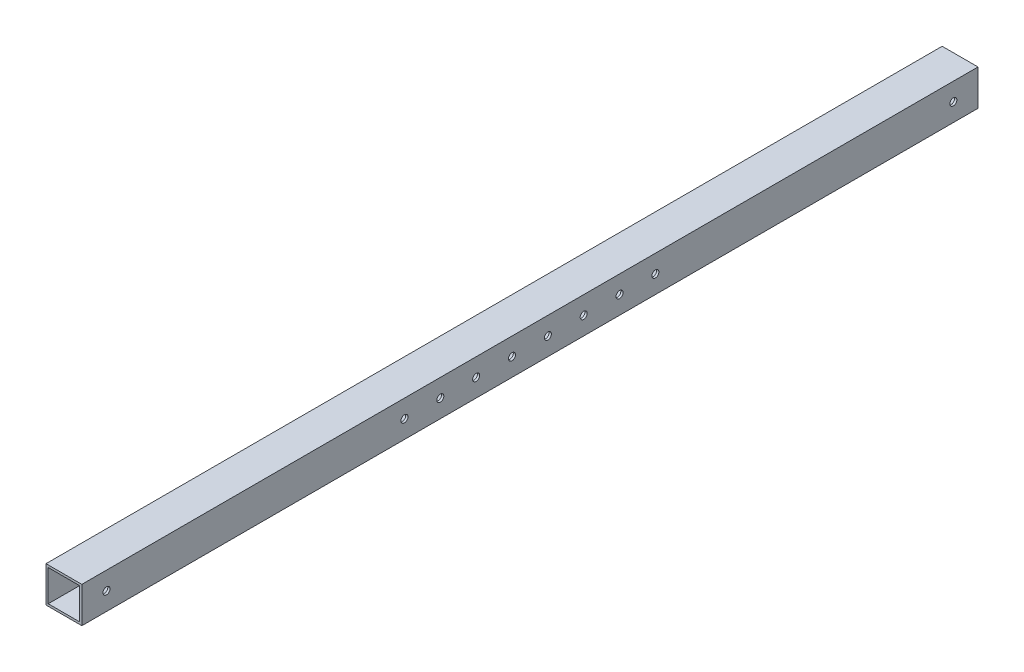
ISO-10303-21;
HEADER;
FILE_DESCRIPTION(('STEP AP214'),'2;1');
FILE_NAME('part.step','',(''),(''),'','','');
FILE_SCHEMA(('AUTOMOTIVE_DESIGN { 1 0 10303 214 1 1 1 1 }'));
ENDSEC;
DATA;
#1=APPLICATION_CONTEXT('core data for automotive mechanical design processes');
#2=APPLICATION_PROTOCOL_DEFINITION('international standard','automotive_design',2000,#1);
#3=PRODUCT_CONTEXT('',#1,'mechanical');
#4=PRODUCT('Part','Part','',(#3));
#5=PRODUCT_RELATED_PRODUCT_CATEGORY('part','',(#4));
#6=PRODUCT_DEFINITION_FORMATION('','',#4);
#7=PRODUCT_DEFINITION_CONTEXT('part definition',#1,'design');
#8=PRODUCT_DEFINITION('design','',#6,#7);
#9=PRODUCT_DEFINITION_SHAPE('','',#8);
#10=(LENGTH_UNIT() NAMED_UNIT(*) SI_UNIT(.MILLI.,.METRE.));
#11=(NAMED_UNIT(*) PLANE_ANGLE_UNIT() SI_UNIT($,.RADIAN.));
#12=(NAMED_UNIT(*) SI_UNIT($,.STERADIAN.) SOLID_ANGLE_UNIT());
#13=UNCERTAINTY_MEASURE_WITH_UNIT(LENGTH_MEASURE(1.E-05),#10,'distance_accuracy_value','');
#14=(GEOMETRIC_REPRESENTATION_CONTEXT(3) GLOBAL_UNCERTAINTY_ASSIGNED_CONTEXT((#13)) GLOBAL_UNIT_ASSIGNED_CONTEXT((#10,
#11,#12)) REPRESENTATION_CONTEXT('',''));
#15=CARTESIAN_POINT('',(0.,0.,0.));
#16=DIRECTION('',(0.,0.,1.));
#17=DIRECTION('',(1.,0.,0.));
#18=AXIS2_PLACEMENT_3D('',#15,#16,#17);
#19=CARTESIAN_POINT('',(-116.088706292712,-80.0228164852255,317.5));
#20=DIRECTION('',(0.,1.,0.));
#21=DIRECTION('',(-1.,0.,0.));
#22=AXIS2_PLACEMENT_3D('',#19,#20,#21);
#23=PLANE('',#22);
#24=DIRECTION('',(1.,0.,0.));
#25=VECTOR('',#24,1.);
#26=CARTESIAN_POINT('',(-116.088706292712,-80.0228164852255,-317.5));
#27=LINE('',#26,#25);
#28=CARTESIAN_POINT('',(-116.088706292712,-80.0228164852255,-317.5));
#29=VERTEX_POINT('',#28);
#30=CARTESIAN_POINT('',(-90.6887062927116,-80.0228164852256,-317.5));
#31=VERTEX_POINT('',#30);
#32=EDGE_CURVE('E11',#29,#31,#27,.T.);
#33=ORIENTED_EDGE('',*,*,#32,.T.);
#34=DIRECTION('',(0.,0.,-1.));
#35=VECTOR('',#34,1.);
#36=CARTESIAN_POINT('',(-90.6887062927116,-80.0228164852256,317.5));
#37=LINE('',#36,#35);
#38=CARTESIAN_POINT('',(-90.6887062927116,-80.0228164852256,317.5));
#39=VERTEX_POINT('',#38);
#40=EDGE_CURVE('E120',#39,#31,#37,.T.);
#41=ORIENTED_EDGE('',*,*,#40,.F.);
#42=DIRECTION('',(1.,0.,0.));
#43=VECTOR('',#42,1.);
#44=CARTESIAN_POINT('',(-116.088706292712,-80.0228164852255,317.5));
#45=LINE('',#44,#43);
#46=CARTESIAN_POINT('',(-116.088706292712,-80.0228164852255,317.5));
#47=VERTEX_POINT('',#46);
#48=EDGE_CURVE('E151',#47,#39,#45,.T.);
#49=ORIENTED_EDGE('',*,*,#48,.F.);
#50=DIRECTION('',(0.,0.,-1.));
#51=VECTOR('',#50,1.);
#52=CARTESIAN_POINT('',(-116.088706292712,-80.0228164852255,317.5));
#53=LINE('',#52,#51);
#54=EDGE_CURVE('E144',#47,#29,#53,.T.);
#55=ORIENTED_EDGE('',*,*,#54,.T.);
#56=EDGE_LOOP('',(#33,#41,#49,#55));
#57=FACE_BOUND('',#56,.T.);
#58=ADVANCED_FACE('F36',(#57),#23,.F.);
#59=CARTESIAN_POINT('',(-90.6887062927116,-80.0228164852256,317.5));
#60=DIRECTION('',(-1.,0.,0.));
#61=DIRECTION('',(0.,-1.,0.));
#62=AXIS2_PLACEMENT_3D('',#59,#60,#61);
#63=PLANE('',#62);
#64=CARTESIAN_POINT('',(-90.6887062927116,-67.3228164852254,88.9));
#65=DIRECTION('',(-1.,0.,0.));
#66=DIRECTION('',(0.,-1.,0.));
#67=AXIS2_PLACEMENT_3D('',#64,#65,#66);
#68=CIRCLE('',#67,2.4892);
#69=CARTESIAN_POINT('',(-90.6887062927116,-69.8120164852254,88.9));
#70=VERTEX_POINT('',#69);
#71=EDGE_CURVE('E224',#70,#70,#68,.T.);
#72=ORIENTED_EDGE('',*,*,#71,.T.);
#73=EDGE_LOOP('',(#72));
#74=FACE_BOUND('',#73,.T.);
#75=CARTESIAN_POINT('',(-90.6887062927116,-67.3228164852255,63.5));
#76=DIRECTION('',(-1.,0.,0.));
#77=DIRECTION('',(0.,-1.,0.));
#78=AXIS2_PLACEMENT_3D('',#75,#76,#77);
#79=CIRCLE('',#78,2.4892);
#80=CARTESIAN_POINT('',(-90.6887062927116,-69.8120164852255,63.5));
#81=VERTEX_POINT('',#80);
#82=EDGE_CURVE('E209',#81,#81,#79,.T.);
#83=ORIENTED_EDGE('',*,*,#82,.T.);
#84=EDGE_LOOP('',(#83));
#85=FACE_BOUND('',#84,.T.);
#86=CARTESIAN_POINT('',(-90.6887062927116,-67.3228164852255,38.1));
#87=DIRECTION('',(-1.,0.,0.));
#88=DIRECTION('',(0.,-1.,0.));
#89=AXIS2_PLACEMENT_3D('',#86,#87,#88);
#90=CIRCLE('',#89,2.4892);
#91=CARTESIAN_POINT('',(-90.6887062927116,-69.8120164852255,38.1));
#92=VERTEX_POINT('',#91);
#93=EDGE_CURVE('E205',#92,#92,#90,.T.);
#94=ORIENTED_EDGE('',*,*,#93,.T.);
#95=EDGE_LOOP('',(#94));
#96=FACE_BOUND('',#95,.T.);
#97=CARTESIAN_POINT('',(-90.6887062927116,-67.3228164852255,12.7));
#98=DIRECTION('',(-1.,0.,0.));
#99=DIRECTION('',(0.,-1.,0.));
#100=AXIS2_PLACEMENT_3D('',#97,#98,#99);
#101=CIRCLE('',#100,2.4892);
#102=CARTESIAN_POINT('',(-90.6887062927116,-69.8120164852255,12.7));
#103=VERTEX_POINT('',#102);
#104=EDGE_CURVE('E201',#103,#103,#101,.T.);
#105=ORIENTED_EDGE('',*,*,#104,.T.);
#106=EDGE_LOOP('',(#105));
#107=FACE_BOUND('',#106,.T.);
#108=CARTESIAN_POINT('',(-90.6887062927116,-67.3228164852255,-12.7));
#109=DIRECTION('',(-1.,0.,0.));
#110=DIRECTION('',(0.,-1.,0.));
#111=AXIS2_PLACEMENT_3D('',#108,#109,#110);
#112=CIRCLE('',#111,2.4892);
#113=CARTESIAN_POINT('',(-90.6887062927116,-69.8120164852255,-12.7));
#114=VERTEX_POINT('',#113);
#115=EDGE_CURVE('E197',#114,#114,#112,.T.);
#116=ORIENTED_EDGE('',*,*,#115,.T.);
#117=EDGE_LOOP('',(#116));
#118=FACE_BOUND('',#117,.T.);
#119=CARTESIAN_POINT('',(-90.6887062927116,-67.3228164852255,-38.1));
#120=DIRECTION('',(-1.,0.,0.));
#121=DIRECTION('',(0.,-1.,0.));
#122=AXIS2_PLACEMENT_3D('',#119,#120,#121);
#123=CIRCLE('',#122,2.4892);
#124=CARTESIAN_POINT('',(-90.6887062927116,-69.8120164852255,-38.1));
#125=VERTEX_POINT('',#124);
#126=EDGE_CURVE('E192',#125,#125,#123,.T.);
#127=ORIENTED_EDGE('',*,*,#126,.T.);
#128=EDGE_LOOP('',(#127));
#129=FACE_BOUND('',#128,.T.);
#130=CARTESIAN_POINT('',(-90.6887062927116,-67.3228164852255,-63.5));
#131=DIRECTION('',(-1.,0.,0.));
#132=DIRECTION('',(0.,-1.,0.));
#133=AXIS2_PLACEMENT_3D('',#130,#131,#132);
#134=CIRCLE('',#133,2.4892);
#135=CARTESIAN_POINT('',(-90.6887062927116,-69.8120164852255,-63.5));
#136=VERTEX_POINT('',#135);
#137=EDGE_CURVE('E187',#136,#136,#134,.T.);
#138=ORIENTED_EDGE('',*,*,#137,.T.);
#139=EDGE_LOOP('',(#138));
#140=FACE_BOUND('',#139,.T.);
#141=CARTESIAN_POINT('',(-90.6887062927116,-67.3228164852255,-88.9));
#142=DIRECTION('',(-1.,0.,0.));
#143=DIRECTION('',(0.,-1.,0.));
#144=AXIS2_PLACEMENT_3D('',#141,#142,#143);
#145=CIRCLE('',#144,2.4892);
#146=CARTESIAN_POINT('',(-90.6887062927116,-69.8120164852255,-88.9));
#147=VERTEX_POINT('',#146);
#148=EDGE_CURVE('E182',#147,#147,#145,.T.);
#149=ORIENTED_EDGE('',*,*,#148,.T.);
#150=EDGE_LOOP('',(#149));
#151=FACE_BOUND('',#150,.T.);
#152=CARTESIAN_POINT('',(-90.6887062927116,-67.3228164852254,300.0375));
#153=DIRECTION('',(-1.,0.,0.));
#154=DIRECTION('',(0.,-1.,0.));
#155=AXIS2_PLACEMENT_3D('',#152,#153,#154);
#156=CIRCLE('',#155,2.48920000000001);
#157=CARTESIAN_POINT('',(-90.6887062927116,-69.8120164852254,300.0375));
#158=VERTEX_POINT('',#157);
#159=EDGE_CURVE('E177',#158,#158,#156,.T.);
#160=ORIENTED_EDGE('',*,*,#159,.T.);
#161=EDGE_LOOP('',(#160));
#162=FACE_BOUND('',#161,.T.);
#163=CARTESIAN_POINT('',(-90.6887062927116,-67.3228164852255,-300.0375));
#164=DIRECTION('',(-1.,0.,0.));
#165=DIRECTION('',(0.,-1.,0.));
#166=AXIS2_PLACEMENT_3D('',#163,#164,#165);
#167=CIRCLE('',#166,2.48920000000002);
#168=CARTESIAN_POINT('',(-90.6887062927116,-69.8120164852255,-300.0375));
#169=VERTEX_POINT('',#168);
#170=EDGE_CURVE('E172',#169,#169,#167,.T.);
#171=ORIENTED_EDGE('',*,*,#170,.T.);
#172=EDGE_LOOP('',(#171));
#173=FACE_BOUND('',#172,.T.);
#174=DIRECTION('',(0.,1.,0.));
#175=VECTOR('',#174,1.);
#176=CARTESIAN_POINT('',(-90.6887062927116,-80.0228164852256,-317.5));
#177=LINE('',#176,#175);
#178=CARTESIAN_POINT('',(-90.6887062927116,-54.6228164852255,-317.5));
#179=VERTEX_POINT('',#178);
#180=EDGE_CURVE('E45',#31,#179,#177,.T.);
#181=ORIENTED_EDGE('',*,*,#180,.T.);
#182=DIRECTION('',(0.,0.,-1.));
#183=VECTOR('',#182,1.);
#184=CARTESIAN_POINT('',(-90.6887062927116,-54.6228164852255,317.5));
#185=LINE('',#184,#183);
#186=CARTESIAN_POINT('',(-90.6887062927116,-54.6228164852255,317.5));
#187=VERTEX_POINT('',#186);
#188=EDGE_CURVE('E139',#187,#179,#185,.T.);
#189=ORIENTED_EDGE('',*,*,#188,.F.);
#190=DIRECTION('',(0.,1.,0.));
#191=VECTOR('',#190,1.);
#192=CARTESIAN_POINT('',(-90.6887062927116,-80.0228164852256,317.5));
#193=LINE('',#192,#191);
#194=EDGE_CURVE('E159',#39,#187,#193,.T.);
#195=ORIENTED_EDGE('',*,*,#194,.F.);
#196=ORIENTED_EDGE('',*,*,#40,.T.);
#197=EDGE_LOOP('',(#181,#189,#195,#196));
#198=FACE_BOUND('',#197,.T.);
#199=ADVANCED_FACE('F248',(#74,#85,#96,#107,#118,#129,#140,#151,#162,#173,#198),#63,.F.);
#200=CARTESIAN_POINT('',(-90.6887062927116,-54.6228164852255,317.5));
#201=DIRECTION('',(0.,-1.,0.));
#202=DIRECTION('',(1.,0.,0.));
#203=AXIS2_PLACEMENT_3D('',#200,#201,#202);
#204=PLANE('',#203);
#205=DIRECTION('',(-1.,0.,0.));
#206=VECTOR('',#205,1.);
#207=CARTESIAN_POINT('',(-90.6887062927116,-54.6228164852255,-317.5));
#208=LINE('',#207,#206);
#209=CARTESIAN_POINT('',(-116.088706292712,-54.6228164852255,-317.5));
#210=VERTEX_POINT('',#209);
#211=EDGE_CURVE('E150',#179,#210,#208,.T.);
#212=ORIENTED_EDGE('',*,*,#211,.T.);
#213=DIRECTION('',(0.,0.,-1.));
#214=VECTOR('',#213,1.);
#215=CARTESIAN_POINT('',(-116.088706292712,-54.6228164852255,317.5));
#216=LINE('',#215,#214);
#217=CARTESIAN_POINT('',(-116.088706292712,-54.6228164852255,317.5));
#218=VERTEX_POINT('',#217);
#219=EDGE_CURVE('E142',#218,#210,#216,.T.);
#220=ORIENTED_EDGE('',*,*,#219,.F.);
#221=DIRECTION('',(-1.,0.,0.));
#222=VECTOR('',#221,1.);
#223=CARTESIAN_POINT('',(-90.6887062927116,-54.6228164852255,317.5));
#224=LINE('',#223,#222);
#225=EDGE_CURVE('E157',#187,#218,#224,.T.);
#226=ORIENTED_EDGE('',*,*,#225,.F.);
#227=ORIENTED_EDGE('',*,*,#188,.T.);
#228=EDGE_LOOP('',(#212,#220,#226,#227));
#229=FACE_BOUND('',#228,.T.);
#230=ADVANCED_FACE('F254',(#229),#204,.F.);
#231=CARTESIAN_POINT('',(-116.088706292712,-80.0228164852255,317.5));
#232=DIRECTION('',(-1.,0.,0.));
#233=DIRECTION('',(0.,0.,1.));
#234=AXIS2_PLACEMENT_3D('',#231,#232,#233);
#235=PLANE('',#234);
#236=CARTESIAN_POINT('',(-116.088706292712,-67.3228164852254,88.9));
#237=DIRECTION('',(-1.,0.,0.));
#238=DIRECTION('',(0.,0.,1.));
#239=AXIS2_PLACEMENT_3D('',#236,#237,#238);
#240=CIRCLE('',#239,2.4892);
#241=CARTESIAN_POINT('',(-116.088706292712,-67.3228164852254,91.3892));
#242=VERTEX_POINT('',#241);
#243=EDGE_CURVE('E167',#242,#242,#240,.T.);
#244=ORIENTED_EDGE('',*,*,#243,.F.);
#245=EDGE_LOOP('',(#244));
#246=FACE_BOUND('',#245,.T.);
#247=CARTESIAN_POINT('',(-116.088706292712,-67.3228164852255,63.5));
#248=DIRECTION('',(-1.,0.,0.));
#249=DIRECTION('',(0.,0.,1.));
#250=AXIS2_PLACEMENT_3D('',#247,#248,#249);
#251=CIRCLE('',#250,2.4892);
#252=CARTESIAN_POINT('',(-116.088706292712,-67.3228164852255,65.9892));
#253=VERTEX_POINT('',#252);
#254=EDGE_CURVE('E609',#253,#253,#251,.T.);
#255=ORIENTED_EDGE('',*,*,#254,.F.);
#256=EDGE_LOOP('',(#255));
#257=FACE_BOUND('',#256,.T.);
#258=CARTESIAN_POINT('',(-116.088706292712,-67.3228164852255,38.1));
#259=DIRECTION('',(-1.,0.,0.));
#260=DIRECTION('',(0.,0.,1.));
#261=AXIS2_PLACEMENT_3D('',#258,#259,#260);
#262=CIRCLE('',#261,2.4892);
#263=CARTESIAN_POINT('',(-116.088706292712,-67.3228164852255,40.5892));
#264=VERTEX_POINT('',#263);
#265=EDGE_CURVE('E606',#264,#264,#262,.T.);
#266=ORIENTED_EDGE('',*,*,#265,.F.);
#267=EDGE_LOOP('',(#266));
#268=FACE_BOUND('',#267,.T.);
#269=CARTESIAN_POINT('',(-116.088706292712,-67.3228164852255,12.7));
#270=DIRECTION('',(-1.,0.,0.));
#271=DIRECTION('',(0.,0.,1.));
#272=AXIS2_PLACEMENT_3D('',#269,#270,#271);
#273=CIRCLE('',#272,2.4892);
#274=CARTESIAN_POINT('',(-116.088706292712,-67.3228164852255,15.1892));
#275=VERTEX_POINT('',#274);
#276=EDGE_CURVE('E603',#275,#275,#273,.T.);
#277=ORIENTED_EDGE('',*,*,#276,.F.);
#278=EDGE_LOOP('',(#277));
#279=FACE_BOUND('',#278,.T.);
#280=CARTESIAN_POINT('',(-116.088706292712,-67.3228164852255,-12.7));
#281=DIRECTION('',(-1.,0.,0.));
#282=DIRECTION('',(0.,0.,1.));
#283=AXIS2_PLACEMENT_3D('',#280,#281,#282);
#284=CIRCLE('',#283,2.4892);
#285=CARTESIAN_POINT('',(-116.088706292712,-67.3228164852255,-10.2108));
#286=VERTEX_POINT('',#285);
#287=EDGE_CURVE('E600',#286,#286,#284,.T.);
#288=ORIENTED_EDGE('',*,*,#287,.F.);
#289=EDGE_LOOP('',(#288));
#290=FACE_BOUND('',#289,.T.);
#291=CARTESIAN_POINT('',(-116.088706292712,-67.3228164852255,-38.1));
#292=DIRECTION('',(-1.,0.,0.));
#293=DIRECTION('',(0.,0.,1.));
#294=AXIS2_PLACEMENT_3D('',#291,#292,#293);
#295=CIRCLE('',#294,2.4892);
#296=CARTESIAN_POINT('',(-116.088706292712,-67.3228164852255,-35.6108));
#297=VERTEX_POINT('',#296);
#298=EDGE_CURVE('E597',#297,#297,#295,.T.);
#299=ORIENTED_EDGE('',*,*,#298,.F.);
#300=EDGE_LOOP('',(#299));
#301=FACE_BOUND('',#300,.T.);
#302=CARTESIAN_POINT('',(-116.088706292712,-67.3228164852255,-63.5));
#303=DIRECTION('',(-1.,0.,0.));
#304=DIRECTION('',(0.,0.,1.));
#305=AXIS2_PLACEMENT_3D('',#302,#303,#304);
#306=CIRCLE('',#305,2.4892);
#307=CARTESIAN_POINT('',(-116.088706292712,-67.3228164852255,-61.0108));
#308=VERTEX_POINT('',#307);
#309=EDGE_CURVE('E594',#308,#308,#306,.T.);
#310=ORIENTED_EDGE('',*,*,#309,.F.);
#311=EDGE_LOOP('',(#310));
#312=FACE_BOUND('',#311,.T.);
#313=CARTESIAN_POINT('',(-116.088706292712,-67.3228164852255,-88.9));
#314=DIRECTION('',(-1.,0.,0.));
#315=DIRECTION('',(0.,0.,1.));
#316=AXIS2_PLACEMENT_3D('',#313,#314,#315);
#317=CIRCLE('',#316,2.4892);
#318=CARTESIAN_POINT('',(-116.088706292712,-67.3228164852255,-86.4108));
#319=VERTEX_POINT('',#318);
#320=EDGE_CURVE('E591',#319,#319,#317,.T.);
#321=ORIENTED_EDGE('',*,*,#320,.F.);
#322=EDGE_LOOP('',(#321));
#323=FACE_BOUND('',#322,.T.);
#324=CARTESIAN_POINT('',(-116.088706292712,-67.3228164852254,300.0375));
#325=DIRECTION('',(-1.,0.,0.));
#326=DIRECTION('',(0.,0.,1.));
#327=AXIS2_PLACEMENT_3D('',#324,#325,#326);
#328=CIRCLE('',#327,2.48920000000001);
#329=CARTESIAN_POINT('',(-116.088706292712,-67.3228164852254,302.5267));
#330=VERTEX_POINT('',#329);
#331=EDGE_CURVE('E588',#330,#330,#328,.T.);
#332=ORIENTED_EDGE('',*,*,#331,.F.);
#333=EDGE_LOOP('',(#332));
#334=FACE_BOUND('',#333,.T.);
#335=CARTESIAN_POINT('',(-116.088706292712,-67.3228164852255,-300.0375));
#336=DIRECTION('',(-1.,0.,0.));
#337=DIRECTION('',(0.,0.,1.));
#338=AXIS2_PLACEMENT_3D('',#335,#336,#337);
#339=CIRCLE('',#338,2.48920000000002);
#340=CARTESIAN_POINT('',(-116.088706292712,-67.3228164852255,-297.5483));
#341=VERTEX_POINT('',#340);
#342=EDGE_CURVE('E585',#341,#341,#339,.T.);
#343=ORIENTED_EDGE('',*,*,#342,.F.);
#344=EDGE_LOOP('',(#343));
#345=FACE_BOUND('',#344,.T.);
#346=DIRECTION('',(0.,1.,0.));
#347=VECTOR('',#346,1.);
#348=CARTESIAN_POINT('',(-116.088706292712,-80.0228164852255,-317.5));
#349=LINE('',#348,#347);
#350=EDGE_CURVE('E147',#29,#210,#349,.T.);
#351=ORIENTED_EDGE('',*,*,#350,.F.);
#352=ORIENTED_EDGE('',*,*,#54,.F.);
#353=DIRECTION('',(0.,1.,0.));
#354=VECTOR('',#353,1.);
#355=CARTESIAN_POINT('',(-116.088706292712,-80.0228164852255,317.5));
#356=LINE('',#355,#354);
#357=EDGE_CURVE('E146',#47,#218,#356,.T.);
#358=ORIENTED_EDGE('',*,*,#357,.T.);
#359=ORIENTED_EDGE('',*,*,#219,.T.);
#360=EDGE_LOOP('',(#351,#352,#358,#359));
#361=FACE_BOUND('',#360,.T.);
#362=ADVANCED_FACE('F261',(#246,#257,#268,#279,#290,#301,#312,#323,#334,#345,#361),#235,.T.);
#363=CARTESIAN_POINT('',(0.,0.,317.5));
#364=DIRECTION('',(0.,0.,1.));
#365=DIRECTION('',(1.,0.,0.));
#366=AXIS2_PLACEMENT_3D('',#363,#364,#365);
#367=PLANE('',#366);
#368=DIRECTION('',(1.,0.,0.));
#369=VECTOR('',#368,1.);
#370=CARTESIAN_POINT('',(-116.088706292712,-78.4353164852255,317.5));
#371=LINE('',#370,#369);
#372=CARTESIAN_POINT('',(-114.501206292712,-78.4353164852255,317.5));
#373=VERTEX_POINT('',#372);
#374=CARTESIAN_POINT('',(-92.2762062927116,-78.4353164852256,317.5));
#375=VERTEX_POINT('',#374);
#376=EDGE_CURVE('E125',#373,#375,#371,.T.);
#377=ORIENTED_EDGE('',*,*,#376,.F.);
#378=DIRECTION('',(0.,1.,0.));
#379=VECTOR('',#378,1.);
#380=CARTESIAN_POINT('',(-114.501206292712,-80.0228164852255,317.5));
#381=LINE('',#380,#379);
#382=CARTESIAN_POINT('',(-114.501206292712,-56.2103164852255,317.5));
#383=VERTEX_POINT('',#382);
#384=EDGE_CURVE('E108',#373,#383,#381,.T.);
#385=ORIENTED_EDGE('',*,*,#384,.T.);
#386=DIRECTION('',(-1.,0.,0.));
#387=VECTOR('',#386,1.);
#388=CARTESIAN_POINT('',(-90.6887062927116,-56.2103164852255,317.5));
#389=LINE('',#388,#387);
#390=CARTESIAN_POINT('',(-92.2762062927116,-56.2103164852255,317.5));
#391=VERTEX_POINT('',#390);
#392=EDGE_CURVE('E134',#391,#383,#389,.T.);
#393=ORIENTED_EDGE('',*,*,#392,.F.);
#394=DIRECTION('',(0.,1.,0.));
#395=VECTOR('',#394,1.);
#396=CARTESIAN_POINT('',(-92.2762062927116,-80.0228164852256,317.5));
#397=LINE('',#396,#395);
#398=EDGE_CURVE('E128',#375,#391,#397,.T.);
#399=ORIENTED_EDGE('',*,*,#398,.F.);
#400=EDGE_LOOP('',(#377,#385,#393,#399));
#401=FACE_BOUND('',#400,.T.);
#402=ORIENTED_EDGE('',*,*,#48,.T.);
#403=ORIENTED_EDGE('',*,*,#194,.T.);
#404=ORIENTED_EDGE('',*,*,#225,.T.);
#405=ORIENTED_EDGE('',*,*,#357,.F.);
#406=EDGE_LOOP('',(#402,#403,#404,#405));
#407=FACE_BOUND('',#406,.T.);
#408=ADVANCED_FACE('F38',(#401,#407),#367,.T.);
#409=CARTESIAN_POINT('',(0.,0.,-317.5));
#410=DIRECTION('',(0.,0.,1.));
#411=DIRECTION('',(1.,0.,0.));
#412=AXIS2_PLACEMENT_3D('',#409,#410,#411);
#413=PLANE('',#412);
#414=DIRECTION('',(0.,1.,0.));
#415=VECTOR('',#414,1.);
#416=CARTESIAN_POINT('',(-114.501206292712,-80.0228164852255,-317.5));
#417=LINE('',#416,#415);
#418=CARTESIAN_POINT('',(-114.501206292712,-78.4353164852255,-317.5));
#419=VERTEX_POINT('',#418);
#420=CARTESIAN_POINT('',(-114.501206292712,-56.2103164852255,-317.5));
#421=VERTEX_POINT('',#420);
#422=EDGE_CURVE('E106',#419,#421,#417,.T.);
#423=ORIENTED_EDGE('',*,*,#422,.F.);
#424=DIRECTION('',(1.,0.,0.));
#425=VECTOR('',#424,1.);
#426=CARTESIAN_POINT('',(-116.088706292712,-78.4353164852255,-317.5));
#427=LINE('',#426,#425);
#428=CARTESIAN_POINT('',(-92.2762062927116,-78.4353164852256,-317.5));
#429=VERTEX_POINT('',#428);
#430=EDGE_CURVE('E114',#419,#429,#427,.T.);
#431=ORIENTED_EDGE('',*,*,#430,.T.);
#432=DIRECTION('',(0.,1.,0.));
#433=VECTOR('',#432,1.);
#434=CARTESIAN_POINT('',(-92.2762062927116,-80.0228164852256,-317.5));
#435=LINE('',#434,#433);
#436=CARTESIAN_POINT('',(-92.2762062927116,-56.2103164852255,-317.5));
#437=VERTEX_POINT('',#436);
#438=EDGE_CURVE('E121',#429,#437,#435,.T.);
#439=ORIENTED_EDGE('',*,*,#438,.T.);
#440=DIRECTION('',(-1.,0.,0.));
#441=VECTOR('',#440,1.);
#442=CARTESIAN_POINT('',(-90.6887062927116,-56.2103164852255,-317.5));
#443=LINE('',#442,#441);
#444=EDGE_CURVE('E60',#437,#421,#443,.T.);
#445=ORIENTED_EDGE('',*,*,#444,.T.);
#446=EDGE_LOOP('',(#423,#431,#439,#445));
#447=FACE_BOUND('',#446,.T.);
#448=ORIENTED_EDGE('',*,*,#32,.F.);
#449=ORIENTED_EDGE('',*,*,#350,.T.);
#450=ORIENTED_EDGE('',*,*,#211,.F.);
#451=ORIENTED_EDGE('',*,*,#180,.F.);
#452=EDGE_LOOP('',(#448,#449,#450,#451));
#453=FACE_BOUND('',#452,.T.);
#454=ADVANCED_FACE('F123',(#447,#453),#413,.F.);
#455=CARTESIAN_POINT('',(-116.088706292712,-78.4353164852255,317.5));
#456=DIRECTION('',(0.,1.,0.));
#457=DIRECTION('',(-1.,0.,0.));
#458=AXIS2_PLACEMENT_3D('',#455,#456,#457);
#459=PLANE('',#458);
#460=ORIENTED_EDGE('',*,*,#430,.F.);
#461=DIRECTION('',(0.,0.,-1.));
#462=VECTOR('',#461,1.);
#463=CARTESIAN_POINT('',(-114.501206292712,-78.4353164852255,317.5));
#464=LINE('',#463,#462);
#465=EDGE_CURVE('E102',#373,#419,#464,.T.);
#466=ORIENTED_EDGE('',*,*,#465,.F.);
#467=ORIENTED_EDGE('',*,*,#376,.T.);
#468=DIRECTION('',(0.,0.,-1.));
#469=VECTOR('',#468,1.);
#470=CARTESIAN_POINT('',(-92.2762062927116,-78.4353164852256,317.5));
#471=LINE('',#470,#469);
#472=EDGE_CURVE('E117',#375,#429,#471,.T.);
#473=ORIENTED_EDGE('',*,*,#472,.T.);
#474=EDGE_LOOP('',(#460,#466,#467,#473));
#475=FACE_BOUND('',#474,.T.);
#476=ADVANCED_FACE('F115',(#475),#459,.T.);
#477=CARTESIAN_POINT('',(-92.2762062927116,-80.0228164852256,317.5));
#478=DIRECTION('',(-1.,0.,0.));
#479=DIRECTION('',(0.,-1.,0.));
#480=AXIS2_PLACEMENT_3D('',#477,#478,#479);
#481=PLANE('',#480);
#482=CARTESIAN_POINT('',(-92.2762062927116,-67.3228164852254,88.9));
#483=DIRECTION('',(-1.,0.,0.));
#484=DIRECTION('',(0.,-1.,0.));
#485=AXIS2_PLACEMENT_3D('',#482,#483,#484);
#486=CIRCLE('',#485,2.4892);
#487=CARTESIAN_POINT('',(-92.2762062927116,-69.8120164852254,88.9));
#488=VERTEX_POINT('',#487);
#489=EDGE_CURVE('E221',#488,#488,#486,.T.);
#490=ORIENTED_EDGE('',*,*,#489,.F.);
#491=EDGE_LOOP('',(#490));
#492=FACE_BOUND('',#491,.T.);
#493=CARTESIAN_POINT('',(-92.2762062927116,-67.3228164852255,63.5));
#494=DIRECTION('',(-1.,0.,0.));
#495=DIRECTION('',(0.,-1.,0.));
#496=AXIS2_PLACEMENT_3D('',#493,#494,#495);
#497=CIRCLE('',#496,2.4892);
#498=CARTESIAN_POINT('',(-92.2762062927116,-69.8120164852255,63.5));
#499=VERTEX_POINT('',#498);
#500=EDGE_CURVE('E204',#499,#499,#497,.T.);
#501=ORIENTED_EDGE('',*,*,#500,.F.);
#502=EDGE_LOOP('',(#501));
#503=FACE_BOUND('',#502,.T.);
#504=CARTESIAN_POINT('',(-92.2762062927116,-67.3228164852255,38.1));
#505=DIRECTION('',(-1.,0.,0.));
#506=DIRECTION('',(0.,-1.,0.));
#507=AXIS2_PLACEMENT_3D('',#504,#505,#506);
#508=CIRCLE('',#507,2.4892);
#509=CARTESIAN_POINT('',(-92.2762062927116,-69.8120164852255,38.1));
#510=VERTEX_POINT('',#509);
#511=EDGE_CURVE('E200',#510,#510,#508,.T.);
#512=ORIENTED_EDGE('',*,*,#511,.F.);
#513=EDGE_LOOP('',(#512));
#514=FACE_BOUND('',#513,.T.);
#515=CARTESIAN_POINT('',(-92.2762062927116,-67.3228164852255,12.7));
#516=DIRECTION('',(-1.,0.,0.));
#517=DIRECTION('',(0.,-1.,0.));
#518=AXIS2_PLACEMENT_3D('',#515,#516,#517);
#519=CIRCLE('',#518,2.4892);
#520=CARTESIAN_POINT('',(-92.2762062927116,-69.8120164852255,12.7));
#521=VERTEX_POINT('',#520);
#522=EDGE_CURVE('E196',#521,#521,#519,.T.);
#523=ORIENTED_EDGE('',*,*,#522,.F.);
#524=EDGE_LOOP('',(#523));
#525=FACE_BOUND('',#524,.T.);
#526=CARTESIAN_POINT('',(-92.2762062927116,-67.3228164852255,-12.7));
#527=DIRECTION('',(-1.,0.,0.));
#528=DIRECTION('',(0.,-1.,0.));
#529=AXIS2_PLACEMENT_3D('',#526,#527,#528);
#530=CIRCLE('',#529,2.4892);
#531=CARTESIAN_POINT('',(-92.2762062927116,-69.8120164852255,-12.7));
#532=VERTEX_POINT('',#531);
#533=EDGE_CURVE('E191',#532,#532,#530,.T.);
#534=ORIENTED_EDGE('',*,*,#533,.F.);
#535=EDGE_LOOP('',(#534));
#536=FACE_BOUND('',#535,.T.);
#537=CARTESIAN_POINT('',(-92.2762062927116,-67.3228164852255,-38.1));
#538=DIRECTION('',(-1.,0.,0.));
#539=DIRECTION('',(0.,-1.,0.));
#540=AXIS2_PLACEMENT_3D('',#537,#538,#539);
#541=CIRCLE('',#540,2.4892);
#542=CARTESIAN_POINT('',(-92.2762062927116,-69.8120164852255,-38.1));
#543=VERTEX_POINT('',#542);
#544=EDGE_CURVE('E186',#543,#543,#541,.T.);
#545=ORIENTED_EDGE('',*,*,#544,.F.);
#546=EDGE_LOOP('',(#545));
#547=FACE_BOUND('',#546,.T.);
#548=CARTESIAN_POINT('',(-92.2762062927116,-67.3228164852255,-63.5));
#549=DIRECTION('',(-1.,0.,0.));
#550=DIRECTION('',(0.,-1.,0.));
#551=AXIS2_PLACEMENT_3D('',#548,#549,#550);
#552=CIRCLE('',#551,2.4892);
#553=CARTESIAN_POINT('',(-92.2762062927116,-69.8120164852255,-63.5));
#554=VERTEX_POINT('',#553);
#555=EDGE_CURVE('E181',#554,#554,#552,.T.);
#556=ORIENTED_EDGE('',*,*,#555,.F.);
#557=EDGE_LOOP('',(#556));
#558=FACE_BOUND('',#557,.T.);
#559=CARTESIAN_POINT('',(-92.2762062927116,-67.3228164852255,-88.9));
#560=DIRECTION('',(-1.,0.,0.));
#561=DIRECTION('',(0.,-1.,0.));
#562=AXIS2_PLACEMENT_3D('',#559,#560,#561);
#563=CIRCLE('',#562,2.4892);
#564=CARTESIAN_POINT('',(-92.2762062927116,-69.8120164852255,-88.9));
#565=VERTEX_POINT('',#564);
#566=EDGE_CURVE('E176',#565,#565,#563,.T.);
#567=ORIENTED_EDGE('',*,*,#566,.F.);
#568=EDGE_LOOP('',(#567));
#569=FACE_BOUND('',#568,.T.);
#570=CARTESIAN_POINT('',(-92.2762062927116,-67.3228164852254,300.0375));
#571=DIRECTION('',(-1.,0.,0.));
#572=DIRECTION('',(0.,-1.,0.));
#573=AXIS2_PLACEMENT_3D('',#570,#571,#572);
#574=CIRCLE('',#573,2.48920000000001);
#575=CARTESIAN_POINT('',(-92.2762062927116,-69.8120164852254,300.0375));
#576=VERTEX_POINT('',#575);
#577=EDGE_CURVE('E171',#576,#576,#574,.T.);
#578=ORIENTED_EDGE('',*,*,#577,.F.);
#579=EDGE_LOOP('',(#578));
#580=FACE_BOUND('',#579,.T.);
#581=CARTESIAN_POINT('',(-92.2762062927116,-67.3228164852255,-300.0375));
#582=DIRECTION('',(-1.,0.,0.));
#583=DIRECTION('',(0.,-1.,0.));
#584=AXIS2_PLACEMENT_3D('',#581,#582,#583);
#585=CIRCLE('',#584,2.48920000000002);
#586=CARTESIAN_POINT('',(-92.2762062927116,-69.8120164852255,-300.0375));
#587=VERTEX_POINT('',#586);
#588=EDGE_CURVE('E166',#587,#587,#585,.T.);
#589=ORIENTED_EDGE('',*,*,#588,.F.);
#590=EDGE_LOOP('',(#589));
#591=FACE_BOUND('',#590,.T.);
#592=ORIENTED_EDGE('',*,*,#438,.F.);
#593=ORIENTED_EDGE('',*,*,#472,.F.);
#594=ORIENTED_EDGE('',*,*,#398,.T.);
#595=DIRECTION('',(0.,0.,-1.));
#596=VECTOR('',#595,1.);
#597=CARTESIAN_POINT('',(-92.2762062927116,-56.2103164852255,317.5));
#598=LINE('',#597,#596);
#599=EDGE_CURVE('E227',#391,#437,#598,.T.);
#600=ORIENTED_EDGE('',*,*,#599,.T.);
#601=EDGE_LOOP('',(#592,#593,#594,#600));
#602=FACE_BOUND('',#601,.T.);
#603=ADVANCED_FACE('F235',(#492,#503,#514,#525,#536,#547,#558,#569,#580,#591,#602),#481,.T.);
#604=CARTESIAN_POINT('',(-90.6887062927116,-56.2103164852255,317.5));
#605=DIRECTION('',(0.,-1.,0.));
#606=DIRECTION('',(1.,0.,0.));
#607=AXIS2_PLACEMENT_3D('',#604,#605,#606);
#608=PLANE('',#607);
#609=ORIENTED_EDGE('',*,*,#444,.F.);
#610=ORIENTED_EDGE('',*,*,#599,.F.);
#611=ORIENTED_EDGE('',*,*,#392,.T.);
#612=DIRECTION('',(0.,0.,-1.));
#613=VECTOR('',#612,1.);
#614=CARTESIAN_POINT('',(-114.501206292712,-56.2103164852255,317.5));
#615=LINE('',#614,#613);
#616=EDGE_CURVE('E53',#383,#421,#615,.T.);
#617=ORIENTED_EDGE('',*,*,#616,.T.);
#618=EDGE_LOOP('',(#609,#610,#611,#617));
#619=FACE_BOUND('',#618,.T.);
#620=ADVANCED_FACE('F229',(#619),#608,.T.);
#621=CARTESIAN_POINT('',(-114.501206292712,-80.0228164852255,317.5));
#622=DIRECTION('',(-1.,0.,0.));
#623=DIRECTION('',(0.,0.,1.));
#624=AXIS2_PLACEMENT_3D('',#621,#622,#623);
#625=PLANE('',#624);
#626=CARTESIAN_POINT('',(-114.501206292712,-67.3228164852254,88.9));
#627=DIRECTION('',(-1.,0.,0.));
#628=DIRECTION('',(0.,0.,1.));
#629=AXIS2_PLACEMENT_3D('',#626,#627,#628);
#630=CIRCLE('',#629,2.4892);
#631=CARTESIAN_POINT('',(-114.501206292712,-67.3228164852254,91.3892));
#632=VERTEX_POINT('',#631);
#633=EDGE_CURVE('E40',#632,#632,#630,.T.);
#634=ORIENTED_EDGE('',*,*,#633,.T.);
#635=EDGE_LOOP('',(#634));
#636=FACE_BOUND('',#635,.T.);
#637=CARTESIAN_POINT('',(-114.501206292712,-67.3228164852255,63.5));
#638=DIRECTION('',(-1.,0.,0.));
#639=DIRECTION('',(0.,0.,1.));
#640=AXIS2_PLACEMENT_3D('',#637,#638,#639);
#641=CIRCLE('',#640,2.4892);
#642=CARTESIAN_POINT('',(-114.501206292712,-67.3228164852255,65.9892));
#643=VERTEX_POINT('',#642);
#644=EDGE_CURVE('E202',#643,#643,#641,.T.);
#645=ORIENTED_EDGE('',*,*,#644,.T.);
#646=EDGE_LOOP('',(#645));
#647=FACE_BOUND('',#646,.T.);
#648=CARTESIAN_POINT('',(-114.501206292712,-67.3228164852255,38.1));
#649=DIRECTION('',(-1.,0.,0.));
#650=DIRECTION('',(0.,0.,1.));
#651=AXIS2_PLACEMENT_3D('',#648,#649,#650);
#652=CIRCLE('',#651,2.4892);
#653=CARTESIAN_POINT('',(-114.501206292712,-67.3228164852255,40.5892));
#654=VERTEX_POINT('',#653);
#655=EDGE_CURVE('E198',#654,#654,#652,.T.);
#656=ORIENTED_EDGE('',*,*,#655,.T.);
#657=EDGE_LOOP('',(#656));
#658=FACE_BOUND('',#657,.T.);
#659=CARTESIAN_POINT('',(-114.501206292712,-67.3228164852255,12.7));
#660=DIRECTION('',(-1.,0.,0.));
#661=DIRECTION('',(0.,0.,1.));
#662=AXIS2_PLACEMENT_3D('',#659,#660,#661);
#663=CIRCLE('',#662,2.4892);
#664=CARTESIAN_POINT('',(-114.501206292712,-67.3228164852255,15.1892));
#665=VERTEX_POINT('',#664);
#666=EDGE_CURVE('E193',#665,#665,#663,.T.);
#667=ORIENTED_EDGE('',*,*,#666,.T.);
#668=EDGE_LOOP('',(#667));
#669=FACE_BOUND('',#668,.T.);
#670=CARTESIAN_POINT('',(-114.501206292712,-67.3228164852255,-12.7));
#671=DIRECTION('',(-1.,0.,0.));
#672=DIRECTION('',(0.,0.,1.));
#673=AXIS2_PLACEMENT_3D('',#670,#671,#672);
#674=CIRCLE('',#673,2.4892);
#675=CARTESIAN_POINT('',(-114.501206292712,-67.3228164852255,-10.2108));
#676=VERTEX_POINT('',#675);
#677=EDGE_CURVE('E188',#676,#676,#674,.T.);
#678=ORIENTED_EDGE('',*,*,#677,.T.);
#679=EDGE_LOOP('',(#678));
#680=FACE_BOUND('',#679,.T.);
#681=CARTESIAN_POINT('',(-114.501206292712,-67.3228164852255,-38.1));
#682=DIRECTION('',(-1.,0.,0.));
#683=DIRECTION('',(0.,0.,1.));
#684=AXIS2_PLACEMENT_3D('',#681,#682,#683);
#685=CIRCLE('',#684,2.4892);
#686=CARTESIAN_POINT('',(-114.501206292712,-67.3228164852255,-35.6108));
#687=VERTEX_POINT('',#686);
#688=EDGE_CURVE('E183',#687,#687,#685,.T.);
#689=ORIENTED_EDGE('',*,*,#688,.T.);
#690=EDGE_LOOP('',(#689));
#691=FACE_BOUND('',#690,.T.);
#692=CARTESIAN_POINT('',(-114.501206292712,-67.3228164852255,-63.5));
#693=DIRECTION('',(-1.,0.,0.));
#694=DIRECTION('',(0.,0.,1.));
#695=AXIS2_PLACEMENT_3D('',#692,#693,#694);
#696=CIRCLE('',#695,2.4892);
#697=CARTESIAN_POINT('',(-114.501206292712,-67.3228164852255,-61.0108));
#698=VERTEX_POINT('',#697);
#699=EDGE_CURVE('E178',#698,#698,#696,.T.);
#700=ORIENTED_EDGE('',*,*,#699,.T.);
#701=EDGE_LOOP('',(#700));
#702=FACE_BOUND('',#701,.T.);
#703=CARTESIAN_POINT('',(-114.501206292712,-67.3228164852255,-88.9));
#704=DIRECTION('',(-1.,0.,0.));
#705=DIRECTION('',(0.,0.,1.));
#706=AXIS2_PLACEMENT_3D('',#703,#704,#705);
#707=CIRCLE('',#706,2.4892);
#708=CARTESIAN_POINT('',(-114.501206292712,-67.3228164852255,-86.4108));
#709=VERTEX_POINT('',#708);
#710=EDGE_CURVE('E173',#709,#709,#707,.T.);
#711=ORIENTED_EDGE('',*,*,#710,.T.);
#712=EDGE_LOOP('',(#711));
#713=FACE_BOUND('',#712,.T.);
#714=CARTESIAN_POINT('',(-114.501206292712,-67.3228164852254,300.0375));
#715=DIRECTION('',(-1.,0.,0.));
#716=DIRECTION('',(0.,0.,1.));
#717=AXIS2_PLACEMENT_3D('',#714,#715,#716);
#718=CIRCLE('',#717,2.48920000000001);
#719=CARTESIAN_POINT('',(-114.501206292712,-67.3228164852254,302.5267));
#720=VERTEX_POINT('',#719);
#721=EDGE_CURVE('E168',#720,#720,#718,.T.);
#722=ORIENTED_EDGE('',*,*,#721,.T.);
#723=EDGE_LOOP('',(#722));
#724=FACE_BOUND('',#723,.T.);
#725=CARTESIAN_POINT('',(-114.501206292712,-67.3228164852255,-300.0375));
#726=DIRECTION('',(-1.,0.,0.));
#727=DIRECTION('',(0.,0.,1.));
#728=AXIS2_PLACEMENT_3D('',#725,#726,#727);
#729=CIRCLE('',#728,2.48920000000002);
#730=CARTESIAN_POINT('',(-114.501206292712,-67.3228164852255,-297.5483));
#731=VERTEX_POINT('',#730);
#732=EDGE_CURVE('E163',#731,#731,#729,.T.);
#733=ORIENTED_EDGE('',*,*,#732,.T.);
#734=EDGE_LOOP('',(#733));
#735=FACE_BOUND('',#734,.T.);
#736=ORIENTED_EDGE('',*,*,#422,.T.);
#737=ORIENTED_EDGE('',*,*,#616,.F.);
#738=ORIENTED_EDGE('',*,*,#384,.F.);
#739=ORIENTED_EDGE('',*,*,#465,.T.);
#740=EDGE_LOOP('',(#736,#737,#738,#739));
#741=FACE_BOUND('',#740,.T.);
#742=ADVANCED_FACE('F104',(#636,#647,#658,#669,#680,#691,#702,#713,#724,#735,#741),#625,.F.);
#743=CARTESIAN_POINT('',(53.9750000000001,-67.3228164852255,-300.0375));
#744=DIRECTION('',(-1.,0.,0.));
#745=DIRECTION('',(0.,0.,1.));
#746=AXIS2_PLACEMENT_3D('',#743,#744,#745);
#747=CYLINDRICAL_SURFACE('',#746,2.48920000000002);
#748=ORIENTED_EDGE('',*,*,#342,.T.);
#749=EDGE_LOOP('',(#748));
#750=FACE_BOUND('',#749,.T.);
#751=ORIENTED_EDGE('',*,*,#732,.F.);
#752=EDGE_LOOP('',(#751));
#753=FACE_BOUND('',#752,.T.);
#754=ADVANCED_FACE('F315',(#750,#753),#747,.F.);
#755=CARTESIAN_POINT('',(53.9750000000001,-67.3228164852254,300.0375));
#756=DIRECTION('',(-1.,0.,0.));
#757=DIRECTION('',(0.,0.,1.));
#758=AXIS2_PLACEMENT_3D('',#755,#756,#757);
#759=CYLINDRICAL_SURFACE('',#758,2.48920000000001);
#760=ORIENTED_EDGE('',*,*,#331,.T.);
#761=EDGE_LOOP('',(#760));
#762=FACE_BOUND('',#761,.T.);
#763=ORIENTED_EDGE('',*,*,#721,.F.);
#764=EDGE_LOOP('',(#763));
#765=FACE_BOUND('',#764,.T.);
#766=ADVANCED_FACE('F324',(#762,#765),#759,.F.);
#767=CARTESIAN_POINT('',(53.9750000000001,-67.3228164852255,-88.9));
#768=DIRECTION('',(-1.,0.,0.));
#769=DIRECTION('',(0.,0.,1.));
#770=AXIS2_PLACEMENT_3D('',#767,#768,#769);
#771=CYLINDRICAL_SURFACE('',#770,2.4892);
#772=ORIENTED_EDGE('',*,*,#320,.T.);
#773=EDGE_LOOP('',(#772));
#774=FACE_BOUND('',#773,.T.);
#775=ORIENTED_EDGE('',*,*,#710,.F.);
#776=EDGE_LOOP('',(#775));
#777=FACE_BOUND('',#776,.T.);
#778=ADVANCED_FACE('F335',(#774,#777),#771,.F.);
#779=CARTESIAN_POINT('',(53.9750000000001,-67.3228164852255,-63.5));
#780=DIRECTION('',(-1.,0.,0.));
#781=DIRECTION('',(0.,0.,1.));
#782=AXIS2_PLACEMENT_3D('',#779,#780,#781);
#783=CYLINDRICAL_SURFACE('',#782,2.4892);
#784=ORIENTED_EDGE('',*,*,#309,.T.);
#785=EDGE_LOOP('',(#784));
#786=FACE_BOUND('',#785,.T.);
#787=ORIENTED_EDGE('',*,*,#699,.F.);
#788=EDGE_LOOP('',(#787));
#789=FACE_BOUND('',#788,.T.);
#790=ADVANCED_FACE('F346',(#786,#789),#783,.F.);
#791=CARTESIAN_POINT('',(53.9750000000001,-67.3228164852255,-38.1));
#792=DIRECTION('',(-1.,0.,0.));
#793=DIRECTION('',(0.,0.,1.));
#794=AXIS2_PLACEMENT_3D('',#791,#792,#793);
#795=CYLINDRICAL_SURFACE('',#794,2.4892);
#796=ORIENTED_EDGE('',*,*,#298,.T.);
#797=EDGE_LOOP('',(#796));
#798=FACE_BOUND('',#797,.T.);
#799=ORIENTED_EDGE('',*,*,#688,.F.);
#800=EDGE_LOOP('',(#799));
#801=FACE_BOUND('',#800,.T.);
#802=ADVANCED_FACE('F357',(#798,#801),#795,.F.);
#803=CARTESIAN_POINT('',(53.9750000000001,-67.3228164852255,-12.7));
#804=DIRECTION('',(-1.,0.,0.));
#805=DIRECTION('',(0.,0.,1.));
#806=AXIS2_PLACEMENT_3D('',#803,#804,#805);
#807=CYLINDRICAL_SURFACE('',#806,2.4892);
#808=ORIENTED_EDGE('',*,*,#287,.T.);
#809=EDGE_LOOP('',(#808));
#810=FACE_BOUND('',#809,.T.);
#811=ORIENTED_EDGE('',*,*,#677,.F.);
#812=EDGE_LOOP('',(#811));
#813=FACE_BOUND('',#812,.T.);
#814=ADVANCED_FACE('F368',(#810,#813),#807,.F.);
#815=CARTESIAN_POINT('',(53.9750000000001,-67.3228164852255,12.7));
#816=DIRECTION('',(-1.,0.,0.));
#817=DIRECTION('',(0.,0.,1.));
#818=AXIS2_PLACEMENT_3D('',#815,#816,#817);
#819=CYLINDRICAL_SURFACE('',#818,2.4892);
#820=ORIENTED_EDGE('',*,*,#276,.T.);
#821=EDGE_LOOP('',(#820));
#822=FACE_BOUND('',#821,.T.);
#823=ORIENTED_EDGE('',*,*,#666,.F.);
#824=EDGE_LOOP('',(#823));
#825=FACE_BOUND('',#824,.T.);
#826=ADVANCED_FACE('F379',(#822,#825),#819,.F.);
#827=CARTESIAN_POINT('',(53.9750000000001,-67.3228164852255,38.1));
#828=DIRECTION('',(-1.,0.,0.));
#829=DIRECTION('',(0.,0.,1.));
#830=AXIS2_PLACEMENT_3D('',#827,#828,#829);
#831=CYLINDRICAL_SURFACE('',#830,2.4892);
#832=ORIENTED_EDGE('',*,*,#265,.T.);
#833=EDGE_LOOP('',(#832));
#834=FACE_BOUND('',#833,.T.);
#835=ORIENTED_EDGE('',*,*,#655,.F.);
#836=EDGE_LOOP('',(#835));
#837=FACE_BOUND('',#836,.T.);
#838=ADVANCED_FACE('F390',(#834,#837),#831,.F.);
#839=CARTESIAN_POINT('',(53.9750000000001,-67.3228164852255,63.5));
#840=DIRECTION('',(-1.,0.,0.));
#841=DIRECTION('',(0.,0.,1.));
#842=AXIS2_PLACEMENT_3D('',#839,#840,#841);
#843=CYLINDRICAL_SURFACE('',#842,2.4892);
#844=ORIENTED_EDGE('',*,*,#254,.T.);
#845=EDGE_LOOP('',(#844));
#846=FACE_BOUND('',#845,.T.);
#847=ORIENTED_EDGE('',*,*,#644,.F.);
#848=EDGE_LOOP('',(#847));
#849=FACE_BOUND('',#848,.T.);
#850=ADVANCED_FACE('F401',(#846,#849),#843,.F.);
#851=CARTESIAN_POINT('',(53.9750000000001,-67.3228164852254,88.9));
#852=DIRECTION('',(-1.,0.,0.));
#853=DIRECTION('',(0.,0.,1.));
#854=AXIS2_PLACEMENT_3D('',#851,#852,#853);
#855=CYLINDRICAL_SURFACE('',#854,2.4892);
#856=ORIENTED_EDGE('',*,*,#243,.T.);
#857=EDGE_LOOP('',(#856));
#858=FACE_BOUND('',#857,.T.);
#859=ORIENTED_EDGE('',*,*,#633,.F.);
#860=EDGE_LOOP('',(#859));
#861=FACE_BOUND('',#860,.T.);
#862=ADVANCED_FACE('F412',(#858,#861),#855,.F.);
#863=ORIENTED_EDGE('',*,*,#588,.T.);
#864=EDGE_LOOP('',(#863));
#865=FACE_BOUND('',#864,.T.);
#866=ORIENTED_EDGE('',*,*,#170,.F.);
#867=EDGE_LOOP('',(#866));
#868=FACE_BOUND('',#867,.T.);
#869=ADVANCED_FACE('F327',(#865,#868),#747,.F.);
#870=ORIENTED_EDGE('',*,*,#577,.T.);
#871=EDGE_LOOP('',(#870));
#872=FACE_BOUND('',#871,.T.);
#873=ORIENTED_EDGE('',*,*,#159,.F.);
#874=EDGE_LOOP('',(#873));
#875=FACE_BOUND('',#874,.T.);
#876=ADVANCED_FACE('F338',(#872,#875),#759,.F.);
#877=ORIENTED_EDGE('',*,*,#566,.T.);
#878=EDGE_LOOP('',(#877));
#879=FACE_BOUND('',#878,.T.);
#880=ORIENTED_EDGE('',*,*,#148,.F.);
#881=EDGE_LOOP('',(#880));
#882=FACE_BOUND('',#881,.T.);
#883=ADVANCED_FACE('F349',(#879,#882),#771,.F.);
#884=ORIENTED_EDGE('',*,*,#555,.T.);
#885=EDGE_LOOP('',(#884));
#886=FACE_BOUND('',#885,.T.);
#887=ORIENTED_EDGE('',*,*,#137,.F.);
#888=EDGE_LOOP('',(#887));
#889=FACE_BOUND('',#888,.T.);
#890=ADVANCED_FACE('F360',(#886,#889),#783,.F.);
#891=ORIENTED_EDGE('',*,*,#544,.T.);
#892=EDGE_LOOP('',(#891));
#893=FACE_BOUND('',#892,.T.);
#894=ORIENTED_EDGE('',*,*,#126,.F.);
#895=EDGE_LOOP('',(#894));
#896=FACE_BOUND('',#895,.T.);
#897=ADVANCED_FACE('F371',(#893,#896),#795,.F.);
#898=ORIENTED_EDGE('',*,*,#533,.T.);
#899=EDGE_LOOP('',(#898));
#900=FACE_BOUND('',#899,.T.);
#901=ORIENTED_EDGE('',*,*,#115,.F.);
#902=EDGE_LOOP('',(#901));
#903=FACE_BOUND('',#902,.T.);
#904=ADVANCED_FACE('F382',(#900,#903),#807,.F.);
#905=ORIENTED_EDGE('',*,*,#522,.T.);
#906=EDGE_LOOP('',(#905));
#907=FACE_BOUND('',#906,.T.);
#908=ORIENTED_EDGE('',*,*,#104,.F.);
#909=EDGE_LOOP('',(#908));
#910=FACE_BOUND('',#909,.T.);
#911=ADVANCED_FACE('F393',(#907,#910),#819,.F.);
#912=ORIENTED_EDGE('',*,*,#511,.T.);
#913=EDGE_LOOP('',(#912));
#914=FACE_BOUND('',#913,.T.);
#915=ORIENTED_EDGE('',*,*,#93,.F.);
#916=EDGE_LOOP('',(#915));
#917=FACE_BOUND('',#916,.T.);
#918=ADVANCED_FACE('F404',(#914,#917),#831,.F.);
#919=ORIENTED_EDGE('',*,*,#500,.T.);
#920=EDGE_LOOP('',(#919));
#921=FACE_BOUND('',#920,.T.);
#922=ORIENTED_EDGE('',*,*,#82,.F.);
#923=EDGE_LOOP('',(#922));
#924=FACE_BOUND('',#923,.T.);
#925=ADVANCED_FACE('F415',(#921,#924),#843,.F.);
#926=ORIENTED_EDGE('',*,*,#489,.T.);
#927=EDGE_LOOP('',(#926));
#928=FACE_BOUND('',#927,.T.);
#929=ORIENTED_EDGE('',*,*,#71,.F.);
#930=EDGE_LOOP('',(#929));
#931=FACE_BOUND('',#930,.T.);
#932=ADVANCED_FACE('F425',(#928,#931),#855,.F.);
#933=CLOSED_SHELL('',(#58,#199,#230,#362,#408,#454,#476,#603,#620,#742,#754,#766,#778,#790,#802,
#814,#826,#838,#850,#862,#869,#876,#883,#890,#897,#904,#911,#918,#925,#932));
#934=MANIFOLD_SOLID_BREP('B2',#933);
#935=ADVANCED_BREP_SHAPE_REPRESENTATION('',(#18,#934),#14);
#936=SHAPE_DEFINITION_REPRESENTATION(#9,#935);
ENDSEC;
END-ISO-10303-21;
